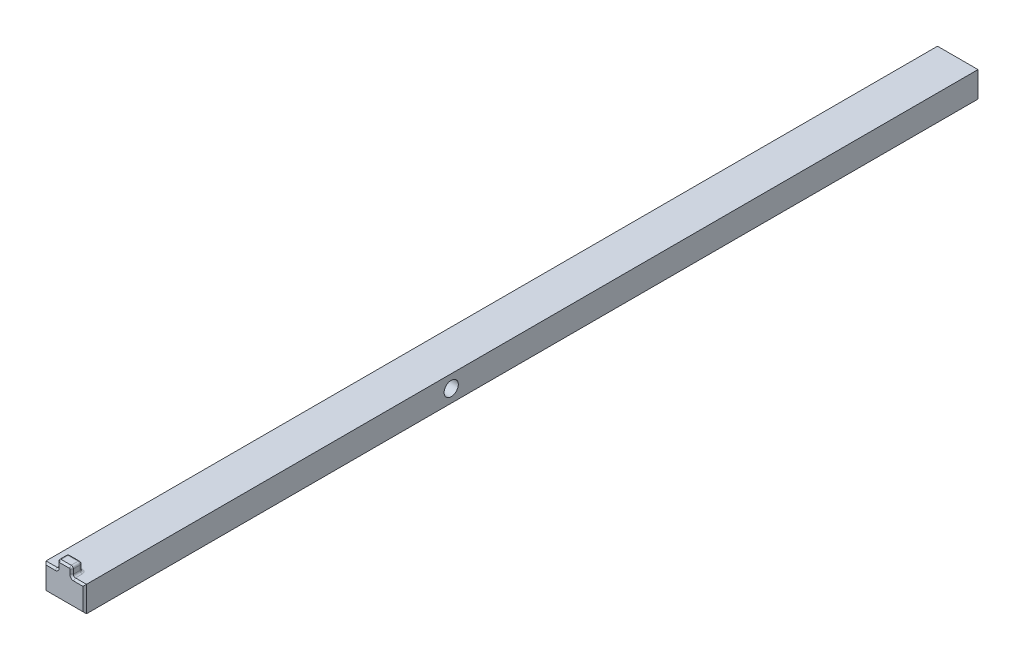
ISO-10303-21;
HEADER;
FILE_DESCRIPTION(('STEP AP214'),'2;1');
FILE_NAME('part.step','',(''),(''),'','','');
FILE_SCHEMA(('AUTOMOTIVE_DESIGN { 1 0 10303 214 1 1 1 1 }'));
ENDSEC;
DATA;
#1=APPLICATION_CONTEXT('core data for automotive mechanical design processes');
#2=APPLICATION_PROTOCOL_DEFINITION('international standard','automotive_design',2000,#1);
#3=PRODUCT_CONTEXT('',#1,'mechanical');
#4=PRODUCT('Part','Part','',(#3));
#5=PRODUCT_RELATED_PRODUCT_CATEGORY('part','',(#4));
#6=PRODUCT_DEFINITION_FORMATION('','',#4);
#7=PRODUCT_DEFINITION_CONTEXT('part definition',#1,'design');
#8=PRODUCT_DEFINITION('design','',#6,#7);
#9=PRODUCT_DEFINITION_SHAPE('','',#8);
#10=(LENGTH_UNIT() NAMED_UNIT(*) SI_UNIT(.MILLI.,.METRE.));
#11=(NAMED_UNIT(*) PLANE_ANGLE_UNIT() SI_UNIT($,.RADIAN.));
#12=(NAMED_UNIT(*) SI_UNIT($,.STERADIAN.) SOLID_ANGLE_UNIT());
#13=UNCERTAINTY_MEASURE_WITH_UNIT(LENGTH_MEASURE(1.E-05),#10,'distance_accuracy_value','');
#14=(GEOMETRIC_REPRESENTATION_CONTEXT(3) GLOBAL_UNCERTAINTY_ASSIGNED_CONTEXT((#13)) GLOBAL_UNIT_ASSIGNED_CONTEXT((#10,
#11,#12)) REPRESENTATION_CONTEXT('',''));
#15=CARTESIAN_POINT('',(0.,0.,0.));
#16=DIRECTION('',(0.,0.,1.));
#17=DIRECTION('',(1.,0.,0.));
#18=AXIS2_PLACEMENT_3D('',#15,#16,#17);
#19=CARTESIAN_POINT('',(5.7,-30.784,-36.82));
#20=DIRECTION('',(0.,-1.,0.));
#21=DIRECTION('',(0.,0.,-1.));
#22=AXIS2_PLACEMENT_3D('',#19,#20,#21);
#23=PLANE('',#22);
#24=DIRECTION('',(0.,0.,1.));
#25=VECTOR('',#24,1.);
#26=CARTESIAN_POINT('',(5.7,-30.784,-36.82));
#27=LINE('',#26,#25);
#28=CARTESIAN_POINT('',(5.7,-30.784,-288.32));
#29=VERTEX_POINT('',#28);
#30=CARTESIAN_POINT('',(5.7,-30.784,-37.32));
#31=VERTEX_POINT('',#30);
#32=EDGE_CURVE('E214',#29,#31,#27,.T.);
#33=ORIENTED_EDGE('',*,*,#32,.F.);
#34=DIRECTION('',(-1.,0.,0.));
#35=VECTOR('',#34,1.);
#36=CARTESIAN_POINT('',(5.7,-30.784,-288.32));
#37=LINE('',#36,#35);
#38=CARTESIAN_POINT('',(-5.7,-30.784,-288.32));
#39=VERTEX_POINT('',#38);
#40=EDGE_CURVE('E307',#29,#39,#37,.T.);
#41=ORIENTED_EDGE('',*,*,#40,.T.);
#42=DIRECTION('',(0.,0.,1.));
#43=VECTOR('',#42,1.);
#44=CARTESIAN_POINT('',(-5.7,-30.784,-36.82));
#45=LINE('',#44,#43);
#46=CARTESIAN_POINT('',(-5.7,-30.784,-37.32));
#47=VERTEX_POINT('',#46);
#48=EDGE_CURVE('E476',#39,#47,#45,.T.);
#49=ORIENTED_EDGE('',*,*,#48,.T.);
#50=DIRECTION('',(1.,0.,0.));
#51=VECTOR('',#50,1.);
#52=CARTESIAN_POINT('',(5.7,-30.784,-37.32));
#53=LINE('',#52,#51);
#54=CARTESIAN_POINT('',(-2.6,-30.784,-37.32));
#55=VERTEX_POINT('',#54);
#56=EDGE_CURVE('E304',#47,#55,#53,.T.);
#57=ORIENTED_EDGE('',*,*,#56,.T.);
#58=DIRECTION('',(0.,0.,1.));
#59=VECTOR('',#58,1.);
#60=CARTESIAN_POINT('',(-2.6,-30.784,-36.82));
#61=LINE('',#60,#59);
#62=CARTESIAN_POINT('',(-2.6,-30.784,-39.22));
#63=VERTEX_POINT('',#62);
#64=EDGE_CURVE('E232',#55,#63,#61,.F.);
#65=ORIENTED_EDGE('',*,*,#64,.T.);
#66=CARTESIAN_POINT('',(-1.4,-30.784,-39.22));
#67=DIRECTION('',(0.,-1.,0.));
#68=DIRECTION('',(0.,0.,-1.));
#69=AXIS2_PLACEMENT_3D('',#66,#67,#68);
#70=CIRCLE('',#69,1.2);
#71=CARTESIAN_POINT('',(-1.4,-30.784,-40.42));
#72=VERTEX_POINT('',#71);
#73=EDGE_CURVE('E229',#72,#63,#70,.F.);
#74=ORIENTED_EDGE('',*,*,#73,.F.);
#75=DIRECTION('',(1.,0.,0.));
#76=VECTOR('',#75,1.);
#77=CARTESIAN_POINT('',(2.,-30.784,-40.42));
#78=LINE('',#77,#76);
#79=CARTESIAN_POINT('',(1.4,-30.784,-40.42));
#80=VERTEX_POINT('',#79);
#81=EDGE_CURVE('E224',#72,#80,#78,.T.);
#82=ORIENTED_EDGE('',*,*,#81,.T.);
#83=CARTESIAN_POINT('',(1.4,-30.784,-39.22));
#84=DIRECTION('',(0.,-1.,0.));
#85=DIRECTION('',(0.,0.,-1.));
#86=AXIS2_PLACEMENT_3D('',#83,#84,#85);
#87=CIRCLE('',#86,1.2);
#88=CARTESIAN_POINT('',(2.6,-30.784,-39.22));
#89=VERTEX_POINT('',#88);
#90=EDGE_CURVE('E221',#89,#80,#87,.F.);
#91=ORIENTED_EDGE('',*,*,#90,.F.);
#92=DIRECTION('',(0.,0.,1.));
#93=VECTOR('',#92,1.);
#94=CARTESIAN_POINT('',(2.6,-30.784,-36.82));
#95=LINE('',#94,#93);
#96=CARTESIAN_POINT('',(2.6,-30.784,-37.32));
#97=VERTEX_POINT('',#96);
#98=EDGE_CURVE('E226',#89,#97,#95,.T.);
#99=ORIENTED_EDGE('',*,*,#98,.T.);
#100=DIRECTION('',(1.,0.,0.));
#101=VECTOR('',#100,1.);
#102=CARTESIAN_POINT('',(5.7,-30.784,-37.32));
#103=LINE('',#102,#101);
#104=EDGE_CURVE('E302',#97,#31,#103,.T.);
#105=ORIENTED_EDGE('',*,*,#104,.T.);
#106=EDGE_LOOP('',(#33,#41,#49,#57,#65,#74,#82,#91,#99,#105));
#107=FACE_BOUND('',#106,.T.);
#108=ADVANCED_FACE('F17',(#107),#23,.F.);
#109=CARTESIAN_POINT('',(5.7,0.,0.));
#110=DIRECTION('',(1.,0.,0.));
#111=DIRECTION('',(0.,0.,-1.));
#112=AXIS2_PLACEMENT_3D('',#109,#110,#111);
#113=PLANE('',#112);
#114=DIRECTION('',(0.,0.,-1.));
#115=VECTOR('',#114,1.);
#116=CARTESIAN_POINT('',(5.7,-37.984,-36.82));
#117=LINE('',#116,#115);
#118=CARTESIAN_POINT('',(5.7,-37.984,-37.32));
#119=VERTEX_POINT('',#118);
#120=CARTESIAN_POINT('',(5.7,-37.984,-288.32));
#121=VERTEX_POINT('',#120);
#122=EDGE_CURVE('E211',#119,#121,#117,.T.);
#123=ORIENTED_EDGE('',*,*,#122,.T.);
#124=DIRECTION('',(0.,1.,0.));
#125=VECTOR('',#124,1.);
#126=CARTESIAN_POINT('',(5.7,-30.784,-288.32));
#127=LINE('',#126,#125);
#128=EDGE_CURVE('E282',#121,#29,#127,.T.);
#129=ORIENTED_EDGE('',*,*,#128,.T.);
#130=ORIENTED_EDGE('',*,*,#32,.T.);
#131=DIRECTION('',(0.,-1.,0.));
#132=VECTOR('',#131,1.);
#133=CARTESIAN_POINT('',(5.7,-37.984,-37.32));
#134=LINE('',#133,#132);
#135=EDGE_CURVE('E254',#31,#119,#134,.T.);
#136=ORIENTED_EDGE('',*,*,#135,.T.);
#137=EDGE_LOOP('',(#123,#129,#130,#136));
#138=FACE_BOUND('',#137,.T.);
#139=CARTESIAN_POINT('',(5.7,-34.384,-140.));
#140=DIRECTION('',(1.,0.,0.));
#141=DIRECTION('',(0.,0.,-1.));
#142=AXIS2_PLACEMENT_3D('',#139,#140,#141);
#143=CIRCLE('',#142,2.);
#144=CARTESIAN_POINT('',(5.7,-34.384,-142.));
#145=VERTEX_POINT('',#144);
#146=EDGE_CURVE('E479',#145,#145,#143,.T.);
#147=ORIENTED_EDGE('',*,*,#146,.F.);
#148=EDGE_LOOP('',(#147));
#149=FACE_BOUND('',#148,.T.);
#150=ADVANCED_FACE('F455',(#138,#149),#113,.T.);
#151=CARTESIAN_POINT('',(-5.7,0.,0.));
#152=DIRECTION('',(1.,0.,0.));
#153=DIRECTION('',(0.,0.,-1.));
#154=AXIS2_PLACEMENT_3D('',#151,#152,#153);
#155=PLANE('',#154);
#156=ORIENTED_EDGE('',*,*,#48,.F.);
#157=DIRECTION('',(0.,-1.,0.));
#158=VECTOR('',#157,1.);
#159=CARTESIAN_POINT('',(-5.7,0.,-288.32));
#160=LINE('',#159,#158);
#161=CARTESIAN_POINT('',(-5.7,-37.984,-288.32));
#162=VERTEX_POINT('',#161);
#163=EDGE_CURVE('E300',#39,#162,#160,.T.);
#164=ORIENTED_EDGE('',*,*,#163,.T.);
#165=DIRECTION('',(0.,0.,-1.));
#166=VECTOR('',#165,1.);
#167=CARTESIAN_POINT('',(-5.7,-37.984,-36.82));
#168=LINE('',#167,#166);
#169=CARTESIAN_POINT('',(-5.7,-37.984,-37.32));
#170=VERTEX_POINT('',#169);
#171=EDGE_CURVE('E217',#170,#162,#168,.T.);
#172=ORIENTED_EDGE('',*,*,#171,.F.);
#173=DIRECTION('',(0.,1.,0.));
#174=VECTOR('',#173,1.);
#175=CARTESIAN_POINT('',(-5.7,0.,-37.32));
#176=LINE('',#175,#174);
#177=EDGE_CURVE('E298',#170,#47,#176,.T.);
#178=ORIENTED_EDGE('',*,*,#177,.T.);
#179=EDGE_LOOP('',(#156,#164,#172,#178));
#180=FACE_BOUND('',#179,.T.);
#181=CARTESIAN_POINT('',(-5.7,-34.384,-140.));
#182=DIRECTION('',(1.,0.,0.));
#183=DIRECTION('',(0.,0.,-1.));
#184=AXIS2_PLACEMENT_3D('',#181,#182,#183);
#185=CIRCLE('',#184,2.);
#186=CARTESIAN_POINT('',(-5.7,-34.384,-142.));
#187=VERTEX_POINT('',#186);
#188=EDGE_CURVE('E280',#187,#187,#185,.T.);
#189=ORIENTED_EDGE('',*,*,#188,.T.);
#190=EDGE_LOOP('',(#189));
#191=FACE_BOUND('',#190,.T.);
#192=ADVANCED_FACE('F487',(#180,#191),#155,.F.);
#193=CARTESIAN_POINT('',(5.7,-30.784,-288.82));
#194=DIRECTION('',(0.,0.,1.));
#195=DIRECTION('',(1.,0.,0.));
#196=AXIS2_PLACEMENT_3D('',#193,#194,#195);
#197=PLANE('',#196);
#198=DIRECTION('',(1.,0.,0.));
#199=VECTOR('',#198,1.);
#200=CARTESIAN_POINT('',(5.7,-31.284,-288.82));
#201=LINE('',#200,#199);
#202=CARTESIAN_POINT('',(-5.19999999999994,-31.284,-288.82));
#203=VERTEX_POINT('',#202);
#204=CARTESIAN_POINT('',(5.19999999999994,-31.284,-288.82));
#205=VERTEX_POINT('',#204);
#206=EDGE_CURVE('E285',#203,#205,#201,.T.);
#207=ORIENTED_EDGE('',*,*,#206,.T.);
#208=DIRECTION('',(0.,-1.,0.));
#209=VECTOR('',#208,1.);
#210=CARTESIAN_POINT('',(5.19999999999994,-37.984,-288.82));
#211=LINE('',#210,#209);
#212=CARTESIAN_POINT('',(5.19999999999994,-37.484,-288.82));
#213=VERTEX_POINT('',#212);
#214=EDGE_CURVE('E291',#205,#213,#211,.T.);
#215=ORIENTED_EDGE('',*,*,#214,.T.);
#216=DIRECTION('',(-1.,0.,0.));
#217=VECTOR('',#216,1.);
#218=CARTESIAN_POINT('',(5.7,-37.484,-288.82));
#219=LINE('',#218,#217);
#220=CARTESIAN_POINT('',(-5.19999999999994,-37.484,-288.82));
#221=VERTEX_POINT('',#220);
#222=EDGE_CURVE('E289',#213,#221,#219,.T.);
#223=ORIENTED_EDGE('',*,*,#222,.T.);
#224=DIRECTION('',(0.,1.,0.));
#225=VECTOR('',#224,1.);
#226=CARTESIAN_POINT('',(-5.19999999999994,-30.784,-288.82));
#227=LINE('',#226,#225);
#228=EDGE_CURVE('E287',#221,#203,#227,.T.);
#229=ORIENTED_EDGE('',*,*,#228,.T.);
#230=EDGE_LOOP('',(#207,#215,#223,#229));
#231=FACE_BOUND('',#230,.T.);
#232=ADVANCED_FACE('F507',(#231),#197,.F.);
#233=CARTESIAN_POINT('',(5.7,-30.784,-36.82));
#234=DIRECTION('',(0.,0.,-1.));
#235=DIRECTION('',(-1.,0.,0.));
#236=AXIS2_PLACEMENT_3D('',#233,#234,#235);
#237=PLANE('',#236);
#238=CARTESIAN_POINT('',(-2.6,-30.184,-36.82));
#239=DIRECTION('',(0.,0.,-1.));
#240=DIRECTION('',(-1.,0.,0.));
#241=AXIS2_PLACEMENT_3D('',#238,#239,#240);
#242=CIRCLE('',#241,1.10000000000002);
#243=CARTESIAN_POINT('',(-1.49999999999997,-30.184,-36.82));
#244=VERTEX_POINT('',#243);
#245=CARTESIAN_POINT('',(-2.6,-31.284,-36.82));
#246=VERTEX_POINT('',#245);
#247=EDGE_CURVE('E329',#244,#246,#242,.T.);
#248=ORIENTED_EDGE('',*,*,#247,.T.);
#249=DIRECTION('',(-1.,0.,0.));
#250=VECTOR('',#249,1.);
#251=CARTESIAN_POINT('',(5.7,-31.284,-36.82));
#252=LINE('',#251,#250);
#253=CARTESIAN_POINT('',(-5.2,-31.284,-36.82));
#254=VERTEX_POINT('',#253);
#255=EDGE_CURVE('E331',#246,#254,#252,.T.);
#256=ORIENTED_EDGE('',*,*,#255,.T.);
#257=DIRECTION('',(0.,-1.,0.));
#258=VECTOR('',#257,1.);
#259=CARTESIAN_POINT('',(-5.2,-30.784,-36.82));
#260=LINE('',#259,#258);
#261=CARTESIAN_POINT('',(-5.2,-37.484,-36.82));
#262=VERTEX_POINT('',#261);
#263=EDGE_CURVE('E313',#254,#262,#260,.T.);
#264=ORIENTED_EDGE('',*,*,#263,.T.);
#265=DIRECTION('',(1.,0.,0.));
#266=VECTOR('',#265,1.);
#267=CARTESIAN_POINT('',(5.7,-37.484,-36.82));
#268=LINE('',#267,#266);
#269=CARTESIAN_POINT('',(5.2,-37.484,-36.82));
#270=VERTEX_POINT('',#269);
#271=EDGE_CURVE('E311',#262,#270,#268,.T.);
#272=ORIENTED_EDGE('',*,*,#271,.T.);
#273=DIRECTION('',(0.,1.,0.));
#274=VECTOR('',#273,1.);
#275=CARTESIAN_POINT('',(5.2,-30.784,-36.82));
#276=LINE('',#275,#274);
#277=CARTESIAN_POINT('',(5.2,-31.284,-36.82));
#278=VERTEX_POINT('',#277);
#279=EDGE_CURVE('E309',#270,#278,#276,.T.);
#280=ORIENTED_EDGE('',*,*,#279,.T.);
#281=DIRECTION('',(-1.,0.,0.));
#282=VECTOR('',#281,1.);
#283=CARTESIAN_POINT('',(5.7,-31.284,-36.82));
#284=LINE('',#283,#282);
#285=CARTESIAN_POINT('',(2.6,-31.284,-36.82));
#286=VERTEX_POINT('',#285);
#287=EDGE_CURVE('E315',#278,#286,#284,.T.);
#288=ORIENTED_EDGE('',*,*,#287,.T.);
#289=CARTESIAN_POINT('',(2.6,-30.184,-36.82));
#290=DIRECTION('',(0.,0.,-1.));
#291=DIRECTION('',(-1.,0.,0.));
#292=AXIS2_PLACEMENT_3D('',#289,#290,#291);
#293=CIRCLE('',#292,1.10000000000002);
#294=CARTESIAN_POINT('',(1.49999999999997,-30.184,-36.82));
#295=VERTEX_POINT('',#294);
#296=EDGE_CURVE('E317',#286,#295,#293,.T.);
#297=ORIENTED_EDGE('',*,*,#296,.T.);
#298=DIRECTION('',(0.,1.,0.));
#299=VECTOR('',#298,1.);
#300=CARTESIAN_POINT('',(1.49999999999997,-28.884,-36.82));
#301=LINE('',#300,#299);
#302=CARTESIAN_POINT('',(1.49999999999997,-28.884,-36.82));
#303=VERTEX_POINT('',#302);
#304=EDGE_CURVE('E319',#295,#303,#301,.T.);
#305=ORIENTED_EDGE('',*,*,#304,.T.);
#306=CARTESIAN_POINT('',(1.4,-28.884,-36.82));
#307=DIRECTION('',(0.,0.,-1.));
#308=DIRECTION('',(-1.,0.,0.));
#309=AXIS2_PLACEMENT_3D('',#306,#307,#308);
#310=CIRCLE('',#309,0.0999999999999716);
#311=CARTESIAN_POINT('',(1.4,-28.784,-36.82));
#312=VERTEX_POINT('',#311);
#313=EDGE_CURVE('E321',#303,#312,#310,.F.);
#314=ORIENTED_EDGE('',*,*,#313,.T.);
#315=DIRECTION('',(-1.,0.,0.));
#316=VECTOR('',#315,1.);
#317=CARTESIAN_POINT('',(-1.4,-28.784,-36.82));
#318=LINE('',#317,#316);
#319=CARTESIAN_POINT('',(-1.4,-28.784,-36.82));
#320=VERTEX_POINT('',#319);
#321=EDGE_CURVE('E323',#312,#320,#318,.T.);
#322=ORIENTED_EDGE('',*,*,#321,.T.);
#323=CARTESIAN_POINT('',(-1.4,-28.884,-36.82));
#324=DIRECTION('',(0.,0.,-1.));
#325=DIRECTION('',(-1.,0.,0.));
#326=AXIS2_PLACEMENT_3D('',#323,#324,#325);
#327=CIRCLE('',#326,0.0999999999999716);
#328=CARTESIAN_POINT('',(-1.49999999999997,-28.884,-36.82));
#329=VERTEX_POINT('',#328);
#330=EDGE_CURVE('E325',#320,#329,#327,.F.);
#331=ORIENTED_EDGE('',*,*,#330,.T.);
#332=DIRECTION('',(0.,-1.,0.));
#333=VECTOR('',#332,1.);
#334=CARTESIAN_POINT('',(-1.49999999999997,-30.184,-36.82));
#335=LINE('',#334,#333);
#336=EDGE_CURVE('E327',#329,#244,#335,.T.);
#337=ORIENTED_EDGE('',*,*,#336,.T.);
#338=EDGE_LOOP('',(#248,#256,#264,#272,#280,#288,#297,#305,#314,#322,#331,#337));
#339=FACE_BOUND('',#338,.T.);
#340=ADVANCED_FACE('F441',(#339),#237,.F.);
#341=CARTESIAN_POINT('',(5.7,-37.984,-36.82));
#342=DIRECTION('',(0.,1.,0.));
#343=DIRECTION('',(0.,0.,1.));
#344=AXIS2_PLACEMENT_3D('',#341,#342,#343);
#345=PLANE('',#344);
#346=ORIENTED_EDGE('',*,*,#171,.T.);
#347=DIRECTION('',(1.,0.,0.));
#348=VECTOR('',#347,1.);
#349=CARTESIAN_POINT('',(5.7,-37.984,-288.32));
#350=LINE('',#349,#348);
#351=EDGE_CURVE('E296',#162,#121,#350,.T.);
#352=ORIENTED_EDGE('',*,*,#351,.T.);
#353=ORIENTED_EDGE('',*,*,#122,.F.);
#354=DIRECTION('',(-1.,0.,0.));
#355=VECTOR('',#354,1.);
#356=CARTESIAN_POINT('',(5.7,-37.984,-37.32));
#357=LINE('',#356,#355);
#358=EDGE_CURVE('E294',#119,#170,#357,.T.);
#359=ORIENTED_EDGE('',*,*,#358,.T.);
#360=EDGE_LOOP('',(#346,#352,#353,#359));
#361=FACE_BOUND('',#360,.T.);
#362=ADVANCED_FACE('F460',(#361),#345,.F.);
#363=CARTESIAN_POINT('',(5.7,-34.384,-140.));
#364=DIRECTION('',(-1.,0.,0.));
#365=DIRECTION('',(0.,0.,1.));
#366=AXIS2_PLACEMENT_3D('',#363,#364,#365);
#367=CYLINDRICAL_SURFACE('',#366,2.);
#368=ORIENTED_EDGE('',*,*,#146,.T.);
#369=EDGE_LOOP('',(#368));
#370=FACE_BOUND('',#369,.T.);
#371=ORIENTED_EDGE('',*,*,#188,.F.);
#372=EDGE_LOOP('',(#371));
#373=FACE_BOUND('',#372,.T.);
#374=ADVANCED_FACE('F489',(#370,#373),#367,.F.);
#375=CARTESIAN_POINT('',(-2.,-28.284,-39.82));
#376=DIRECTION('',(-1.,0.,0.));
#377=DIRECTION('',(0.,0.,1.));
#378=AXIS2_PLACEMENT_3D('',#375,#376,#377);
#379=PLANE('',#378);
#380=DIRECTION('',(0.,0.,1.));
#381=VECTOR('',#380,1.);
#382=CARTESIAN_POINT('',(-2.,-30.184,-39.82));
#383=LINE('',#382,#381);
#384=CARTESIAN_POINT('',(-2.,-30.184,-39.22));
#385=VERTEX_POINT('',#384);
#386=CARTESIAN_POINT('',(-2.,-30.184,-37.32));
#387=VERTEX_POINT('',#386);
#388=EDGE_CURVE('E185',#385,#387,#383,.T.);
#389=ORIENTED_EDGE('',*,*,#388,.T.);
#390=DIRECTION('',(0.,1.,0.));
#391=VECTOR('',#390,1.);
#392=CARTESIAN_POINT('',(-2.,-28.884,-37.32));
#393=LINE('',#392,#391);
#394=CARTESIAN_POINT('',(-2.,-28.884,-37.32));
#395=VERTEX_POINT('',#394);
#396=EDGE_CURVE('E182',#387,#395,#393,.T.);
#397=ORIENTED_EDGE('',*,*,#396,.T.);
#398=DIRECTION('',(0.,0.,1.));
#399=VECTOR('',#398,1.);
#400=CARTESIAN_POINT('',(-2.,-28.884,-39.82));
#401=LINE('',#400,#399);
#402=CARTESIAN_POINT('',(-2.,-28.884,-39.22));
#403=VERTEX_POINT('',#402);
#404=EDGE_CURVE('E174',#395,#403,#401,.F.);
#405=ORIENTED_EDGE('',*,*,#404,.T.);
#406=DIRECTION('',(0.,-1.,0.));
#407=VECTOR('',#406,1.);
#408=CARTESIAN_POINT('',(-2.,-30.784,-39.22));
#409=LINE('',#408,#407);
#410=EDGE_CURVE('E179',#403,#385,#409,.T.);
#411=ORIENTED_EDGE('',*,*,#410,.T.);
#412=EDGE_LOOP('',(#389,#397,#405,#411));
#413=FACE_BOUND('',#412,.T.);
#414=ADVANCED_FACE('F177',(#413),#379,.T.);
#415=CARTESIAN_POINT('',(2.,-28.284,-39.82));
#416=DIRECTION('',(0.,1.,0.));
#417=DIRECTION('',(0.,0.,1.));
#418=AXIS2_PLACEMENT_3D('',#415,#416,#417);
#419=PLANE('',#418);
#420=DIRECTION('',(0.,0.,1.));
#421=VECTOR('',#420,1.);
#422=CARTESIAN_POINT('',(-1.4,-28.284,-39.82));
#423=LINE('',#422,#421);
#424=CARTESIAN_POINT('',(-1.4,-28.284,-39.22));
#425=VERTEX_POINT('',#424);
#426=CARTESIAN_POINT('',(-1.4,-28.284,-37.32));
#427=VERTEX_POINT('',#426);
#428=EDGE_CURVE('E193',#425,#427,#423,.T.);
#429=ORIENTED_EDGE('',*,*,#428,.T.);
#430=DIRECTION('',(1.,0.,0.));
#431=VECTOR('',#430,1.);
#432=CARTESIAN_POINT('',(1.4,-28.284,-37.32));
#433=LINE('',#432,#431);
#434=CARTESIAN_POINT('',(1.4,-28.284,-37.32));
#435=VERTEX_POINT('',#434);
#436=EDGE_CURVE('E339',#427,#435,#433,.T.);
#437=ORIENTED_EDGE('',*,*,#436,.T.);
#438=DIRECTION('',(0.,0.,1.));
#439=VECTOR('',#438,1.);
#440=CARTESIAN_POINT('',(1.4,-28.284,-39.82));
#441=LINE('',#440,#439);
#442=CARTESIAN_POINT('',(1.4,-28.284,-39.22));
#443=VERTEX_POINT('',#442);
#444=EDGE_CURVE('E242',#435,#443,#441,.F.);
#445=ORIENTED_EDGE('',*,*,#444,.T.);
#446=DIRECTION('',(-1.,0.,0.));
#447=VECTOR('',#446,1.);
#448=CARTESIAN_POINT('',(-2.,-28.284,-39.22));
#449=LINE('',#448,#447);
#450=EDGE_CURVE('E240',#443,#425,#449,.T.);
#451=ORIENTED_EDGE('',*,*,#450,.T.);
#452=EDGE_LOOP('',(#429,#437,#445,#451));
#453=FACE_BOUND('',#452,.T.);
#454=ADVANCED_FACE('F429',(#453),#419,.T.);
#455=CARTESIAN_POINT('',(2.,-30.784,-39.82));
#456=DIRECTION('',(1.,0.,0.));
#457=DIRECTION('',(0.,0.,-1.));
#458=AXIS2_PLACEMENT_3D('',#455,#456,#457);
#459=PLANE('',#458);
#460=DIRECTION('',(0.,0.,1.));
#461=VECTOR('',#460,1.);
#462=CARTESIAN_POINT('',(2.,-28.884,-39.82));
#463=LINE('',#462,#461);
#464=CARTESIAN_POINT('',(2.,-28.884,-39.22));
#465=VERTEX_POINT('',#464);
#466=CARTESIAN_POINT('',(2.,-28.884,-37.32));
#467=VERTEX_POINT('',#466);
#468=EDGE_CURVE('E236',#465,#467,#463,.T.);
#469=ORIENTED_EDGE('',*,*,#468,.T.);
#470=DIRECTION('',(0.,-1.,0.));
#471=VECTOR('',#470,1.);
#472=CARTESIAN_POINT('',(2.,-30.184,-37.32));
#473=LINE('',#472,#471);
#474=CARTESIAN_POINT('',(2.,-30.184,-37.32));
#475=VERTEX_POINT('',#474);
#476=EDGE_CURVE('E27',#467,#475,#473,.T.);
#477=ORIENTED_EDGE('',*,*,#476,.T.);
#478=DIRECTION('',(0.,0.,1.));
#479=VECTOR('',#478,1.);
#480=CARTESIAN_POINT('',(2.,-30.184,-39.82));
#481=LINE('',#480,#479);
#482=CARTESIAN_POINT('',(2.,-30.184,-39.22));
#483=VERTEX_POINT('',#482);
#484=EDGE_CURVE('E238',#475,#483,#481,.F.);
#485=ORIENTED_EDGE('',*,*,#484,.T.);
#486=DIRECTION('',(0.,1.,0.));
#487=VECTOR('',#486,1.);
#488=CARTESIAN_POINT('',(2.,-28.284,-39.22));
#489=LINE('',#488,#487);
#490=EDGE_CURVE('E234',#483,#465,#489,.T.);
#491=ORIENTED_EDGE('',*,*,#490,.T.);
#492=EDGE_LOOP('',(#469,#477,#485,#491));
#493=FACE_BOUND('',#492,.T.);
#494=ADVANCED_FACE('F419',(#493),#459,.T.);
#495=CARTESIAN_POINT('',(0.,0.,-39.82));
#496=DIRECTION('',(0.,0.,1.));
#497=DIRECTION('',(1.,0.,0.));
#498=AXIS2_PLACEMENT_3D('',#495,#496,#497);
#499=PLANE('',#498);
#500=DIRECTION('',(1.,0.,0.));
#501=VECTOR('',#500,1.);
#502=CARTESIAN_POINT('',(-2.,-30.184,-39.82));
#503=LINE('',#502,#501);
#504=CARTESIAN_POINT('',(1.4,-30.184,-39.82));
#505=VERTEX_POINT('',#504);
#506=CARTESIAN_POINT('',(-1.4,-30.184,-39.82));
#507=VERTEX_POINT('',#506);
#508=EDGE_CURVE('E247',#505,#507,#503,.F.);
#509=ORIENTED_EDGE('',*,*,#508,.T.);
#510=DIRECTION('',(0.,-1.,0.));
#511=VECTOR('',#510,1.);
#512=CARTESIAN_POINT('',(-1.4,-28.284,-39.82));
#513=LINE('',#512,#511);
#514=CARTESIAN_POINT('',(-1.4,-28.884,-39.82));
#515=VERTEX_POINT('',#514);
#516=EDGE_CURVE('E252',#507,#515,#513,.F.);
#517=ORIENTED_EDGE('',*,*,#516,.T.);
#518=DIRECTION('',(-1.,0.,0.));
#519=VECTOR('',#518,1.);
#520=CARTESIAN_POINT('',(2.,-28.884,-39.82));
#521=LINE('',#520,#519);
#522=CARTESIAN_POINT('',(1.4,-28.884,-39.82));
#523=VERTEX_POINT('',#522);
#524=EDGE_CURVE('E249',#515,#523,#521,.F.);
#525=ORIENTED_EDGE('',*,*,#524,.T.);
#526=DIRECTION('',(0.,1.,0.));
#527=VECTOR('',#526,1.);
#528=CARTESIAN_POINT('',(1.4,-30.784,-39.82));
#529=LINE('',#528,#527);
#530=EDGE_CURVE('E245',#523,#505,#529,.F.);
#531=ORIENTED_EDGE('',*,*,#530,.T.);
#532=EDGE_LOOP('',(#509,#517,#525,#531));
#533=FACE_BOUND('',#532,.T.);
#534=ADVANCED_FACE('F412',(#533),#499,.F.);
#535=CARTESIAN_POINT('',(1.4,-28.884,-39.82));
#536=DIRECTION('',(0.,0.,1.));
#537=DIRECTION('',(1.,0.,0.));
#538=AXIS2_PLACEMENT_3D('',#535,#536,#537);
#539=CYLINDRICAL_SURFACE('',#538,0.6);
#540=ORIENTED_EDGE('',*,*,#444,.F.);
#541=CARTESIAN_POINT('',(1.4,-28.884,-37.32));
#542=DIRECTION('',(0.,0.,-1.));
#543=DIRECTION('',(-1.,0.,0.));
#544=AXIS2_PLACEMENT_3D('',#541,#542,#543);
#545=CIRCLE('',#544,0.6);
#546=EDGE_CURVE('E42',#435,#467,#545,.T.);
#547=ORIENTED_EDGE('',*,*,#546,.T.);
#548=ORIENTED_EDGE('',*,*,#468,.F.);
#549=CARTESIAN_POINT('',(1.4,-28.884,-39.22));
#550=DIRECTION('',(0.,0.,-1.));
#551=DIRECTION('',(-1.,0.,0.));
#552=AXIS2_PLACEMENT_3D('',#549,#550,#551);
#553=CIRCLE('',#552,0.6);
#554=EDGE_CURVE('E277',#443,#465,#553,.T.);
#555=ORIENTED_EDGE('',*,*,#554,.F.);
#556=EDGE_LOOP('',(#540,#547,#548,#555));
#557=FACE_BOUND('',#556,.T.);
#558=ADVANCED_FACE('F421',(#557),#539,.T.);
#559=CARTESIAN_POINT('',(1.4,-28.884,-39.22));
#560=DIRECTION('',(1.,0.,0.));
#561=DIRECTION('',(0.,0.,-1.));
#562=AXIS2_PLACEMENT_3D('',#559,#560,#561);
#563=SPHERICAL_SURFACE('',#562,0.6);
#564=CARTESIAN_POINT('',(1.4,-28.884,-39.22));
#565=DIRECTION('',(1.,0.,0.));
#566=DIRECTION('',(0.,0.,-1.));
#567=AXIS2_PLACEMENT_3D('',#564,#565,#566);
#568=CIRCLE('',#567,0.6);
#569=EDGE_CURVE('E271',#443,#523,#568,.F.);
#570=ORIENTED_EDGE('',*,*,#569,.F.);
#571=ORIENTED_EDGE('',*,*,#554,.T.);
#572=CARTESIAN_POINT('',(1.4,-28.884,-39.22));
#573=DIRECTION('',(0.,1.,0.));
#574=DIRECTION('',(0.,0.,1.));
#575=AXIS2_PLACEMENT_3D('',#572,#573,#574);
#576=CIRCLE('',#575,0.6);
#577=EDGE_CURVE('E274',#523,#465,#576,.F.);
#578=ORIENTED_EDGE('',*,*,#577,.F.);
#579=EDGE_LOOP('',(#570,#571,#578));
#580=FACE_BOUND('',#579,.T.);
#581=ADVANCED_FACE('F424',(#580),#563,.T.);
#582=CARTESIAN_POINT('',(2.6,-30.184,-36.82));
#583=DIRECTION('',(0.,0.,1.));
#584=DIRECTION('',(0.,-1.,0.));
#585=AXIS2_PLACEMENT_3D('',#582,#583,#584);
#586=CYLINDRICAL_SURFACE('',#585,0.6);
#587=ORIENTED_EDGE('',*,*,#484,.F.);
#588=CARTESIAN_POINT('',(2.6,-30.184,-37.32));
#589=DIRECTION('',(0.,0.,-1.));
#590=DIRECTION('',(-1.,0.,0.));
#591=AXIS2_PLACEMENT_3D('',#588,#589,#590);
#592=CIRCLE('',#591,0.6);
#593=EDGE_CURVE('E11',#475,#97,#592,.F.);
#594=ORIENTED_EDGE('',*,*,#593,.T.);
#595=ORIENTED_EDGE('',*,*,#98,.F.);
#596=CARTESIAN_POINT('',(2.6,-30.184,-39.22));
#597=DIRECTION('',(0.,0.,1.));
#598=DIRECTION('',(1.,0.,0.));
#599=AXIS2_PLACEMENT_3D('',#596,#597,#598);
#600=CIRCLE('',#599,0.6);
#601=EDGE_CURVE('E268',#483,#89,#600,.T.);
#602=ORIENTED_EDGE('',*,*,#601,.F.);
#603=EDGE_LOOP('',(#587,#594,#595,#602));
#604=FACE_BOUND('',#603,.T.);
#605=ADVANCED_FACE('F398',(#604),#586,.F.);
#606=CARTESIAN_POINT('',(1.4,-30.784,-39.22));
#607=DIRECTION('',(0.,-1.,0.));
#608=DIRECTION('',(0.,0.,-1.));
#609=AXIS2_PLACEMENT_3D('',#606,#607,#608);
#610=CYLINDRICAL_SURFACE('',#609,0.6);
#611=ORIENTED_EDGE('',*,*,#577,.T.);
#612=ORIENTED_EDGE('',*,*,#490,.F.);
#613=CARTESIAN_POINT('',(1.4,-30.184,-39.22));
#614=DIRECTION('',(0.,-1.,0.));
#615=DIRECTION('',(0.,0.,-1.));
#616=AXIS2_PLACEMENT_3D('',#613,#614,#615);
#617=CIRCLE('',#616,0.6);
#618=EDGE_CURVE('E265',#505,#483,#617,.T.);
#619=ORIENTED_EDGE('',*,*,#618,.F.);
#620=ORIENTED_EDGE('',*,*,#530,.F.);
#621=EDGE_LOOP('',(#611,#612,#619,#620));
#622=FACE_BOUND('',#621,.T.);
#623=ADVANCED_FACE('F418',(#622),#610,.T.);
#624=CARTESIAN_POINT('',(2.,-28.884,-39.22));
#625=DIRECTION('',(1.,0.,0.));
#626=DIRECTION('',(0.,0.,-1.));
#627=AXIS2_PLACEMENT_3D('',#624,#625,#626);
#628=CYLINDRICAL_SURFACE('',#627,0.6);
#629=ORIENTED_EDGE('',*,*,#569,.T.);
#630=ORIENTED_EDGE('',*,*,#524,.F.);
#631=CARTESIAN_POINT('',(-1.4,-28.884,-39.22));
#632=DIRECTION('',(-1.,0.,0.));
#633=DIRECTION('',(0.,0.,1.));
#634=AXIS2_PLACEMENT_3D('',#631,#632,#633);
#635=CIRCLE('',#634,0.6);
#636=EDGE_CURVE('E197',#425,#515,#635,.T.);
#637=ORIENTED_EDGE('',*,*,#636,.F.);
#638=ORIENTED_EDGE('',*,*,#450,.F.);
#639=EDGE_LOOP('',(#629,#630,#637,#638));
#640=FACE_BOUND('',#639,.T.);
#641=ADVANCED_FACE('F427',(#640),#628,.T.);
#642=CARTESIAN_POINT('',(-1.4,-28.884,-39.82));
#643=DIRECTION('',(0.,0.,1.));
#644=DIRECTION('',(1.,0.,0.));
#645=AXIS2_PLACEMENT_3D('',#642,#643,#644);
#646=CYLINDRICAL_SURFACE('',#645,0.6);
#647=ORIENTED_EDGE('',*,*,#404,.F.);
#648=CARTESIAN_POINT('',(-1.4,-28.884,-37.32));
#649=DIRECTION('',(0.,0.,-1.));
#650=DIRECTION('',(-1.,0.,0.));
#651=AXIS2_PLACEMENT_3D('',#648,#649,#650);
#652=CIRCLE('',#651,0.6);
#653=EDGE_CURVE('E337',#395,#427,#652,.T.);
#654=ORIENTED_EDGE('',*,*,#653,.T.);
#655=ORIENTED_EDGE('',*,*,#428,.F.);
#656=CARTESIAN_POINT('',(-1.4,-28.884,-39.22));
#657=DIRECTION('',(0.,0.,-1.));
#658=DIRECTION('',(-1.,0.,0.));
#659=AXIS2_PLACEMENT_3D('',#656,#657,#658);
#660=CIRCLE('',#659,0.6);
#661=EDGE_CURVE('E189',#403,#425,#660,.T.);
#662=ORIENTED_EDGE('',*,*,#661,.F.);
#663=EDGE_LOOP('',(#647,#654,#655,#662));
#664=FACE_BOUND('',#663,.T.);
#665=ADVANCED_FACE('F191',(#664),#646,.T.);
#666=CARTESIAN_POINT('',(1.4,-30.184,-39.22));
#667=DIRECTION('',(0.,-1.,0.));
#668=DIRECTION('',(0.,0.,-1.));
#669=AXIS2_PLACEMENT_3D('',#666,#667,#668);
#670=TOROIDAL_SURFACE('',#669,1.2,0.6);
#671=ORIENTED_EDGE('',*,*,#601,.T.);
#672=ORIENTED_EDGE('',*,*,#90,.T.);
#673=CARTESIAN_POINT('',(1.4,-30.184,-40.42));
#674=DIRECTION('',(-1.,0.,0.));
#675=DIRECTION('',(0.,0.,1.));
#676=AXIS2_PLACEMENT_3D('',#673,#674,#675);
#677=CIRCLE('',#676,0.6);
#678=EDGE_CURVE('E198',#505,#80,#677,.F.);
#679=ORIENTED_EDGE('',*,*,#678,.F.);
#680=ORIENTED_EDGE('',*,*,#618,.T.);
#681=EDGE_LOOP('',(#671,#672,#679,#680));
#682=FACE_BOUND('',#681,.T.);
#683=ADVANCED_FACE('F406',(#682),#670,.F.);
#684=CARTESIAN_POINT('',(-1.4,-28.884,-39.22));
#685=DIRECTION('',(0.,1.,0.));
#686=DIRECTION('',(0.,0.,1.));
#687=AXIS2_PLACEMENT_3D('',#684,#685,#686);
#688=SPHERICAL_SURFACE('',#687,0.6);
#689=ORIENTED_EDGE('',*,*,#661,.T.);
#690=ORIENTED_EDGE('',*,*,#636,.T.);
#691=CARTESIAN_POINT('',(-1.4,-28.884,-39.22));
#692=DIRECTION('',(0.,1.,0.));
#693=DIRECTION('',(0.,0.,1.));
#694=AXIS2_PLACEMENT_3D('',#691,#692,#693);
#695=CIRCLE('',#694,0.6);
#696=EDGE_CURVE('E201',#403,#515,#695,.F.);
#697=ORIENTED_EDGE('',*,*,#696,.F.);
#698=EDGE_LOOP('',(#689,#690,#697));
#699=FACE_BOUND('',#698,.T.);
#700=ADVANCED_FACE('F202',(#699),#688,.T.);
#701=CARTESIAN_POINT('',(5.7,-30.184,-40.42));
#702=DIRECTION('',(-1.,0.,0.));
#703=DIRECTION('',(0.,0.,1.));
#704=AXIS2_PLACEMENT_3D('',#701,#702,#703);
#705=CYLINDRICAL_SURFACE('',#704,0.6);
#706=ORIENTED_EDGE('',*,*,#678,.T.);
#707=ORIENTED_EDGE('',*,*,#81,.F.);
#708=CARTESIAN_POINT('',(-1.4,-30.184,-40.42));
#709=DIRECTION('',(1.,0.,0.));
#710=DIRECTION('',(0.,0.,-1.));
#711=AXIS2_PLACEMENT_3D('',#708,#709,#710);
#712=CIRCLE('',#711,0.6);
#713=EDGE_CURVE('E205',#507,#72,#712,.T.);
#714=ORIENTED_EDGE('',*,*,#713,.F.);
#715=ORIENTED_EDGE('',*,*,#508,.F.);
#716=EDGE_LOOP('',(#706,#707,#714,#715));
#717=FACE_BOUND('',#716,.T.);
#718=ADVANCED_FACE('F409',(#717),#705,.F.);
#719=CARTESIAN_POINT('',(-1.4,-28.284,-39.22));
#720=DIRECTION('',(0.,1.,0.));
#721=DIRECTION('',(0.,0.,1.));
#722=AXIS2_PLACEMENT_3D('',#719,#720,#721);
#723=CYLINDRICAL_SURFACE('',#722,0.6);
#724=ORIENTED_EDGE('',*,*,#696,.T.);
#725=ORIENTED_EDGE('',*,*,#516,.F.);
#726=CARTESIAN_POINT('',(-1.4,-30.184,-39.22));
#727=DIRECTION('',(0.,-1.,0.));
#728=DIRECTION('',(0.,0.,-1.));
#729=AXIS2_PLACEMENT_3D('',#726,#727,#728);
#730=CIRCLE('',#729,0.6);
#731=EDGE_CURVE('E209',#385,#507,#730,.T.);
#732=ORIENTED_EDGE('',*,*,#731,.F.);
#733=ORIENTED_EDGE('',*,*,#410,.F.);
#734=EDGE_LOOP('',(#724,#725,#732,#733));
#735=FACE_BOUND('',#734,.T.);
#736=ADVANCED_FACE('F207',(#735),#723,.T.);
#737=CARTESIAN_POINT('',(-1.4,-30.184,-39.22));
#738=DIRECTION('',(0.,-1.,0.));
#739=DIRECTION('',(0.,0.,-1.));
#740=AXIS2_PLACEMENT_3D('',#737,#738,#739);
#741=TOROIDAL_SURFACE('',#740,1.2,0.6);
#742=ORIENTED_EDGE('',*,*,#713,.T.);
#743=ORIENTED_EDGE('',*,*,#73,.T.);
#744=CARTESIAN_POINT('',(-2.6,-30.184,-39.22));
#745=DIRECTION('',(0.,0.,1.));
#746=DIRECTION('',(1.,0.,0.));
#747=AXIS2_PLACEMENT_3D('',#744,#745,#746);
#748=CIRCLE('',#747,0.6);
#749=EDGE_CURVE('E255',#385,#63,#748,.F.);
#750=ORIENTED_EDGE('',*,*,#749,.F.);
#751=ORIENTED_EDGE('',*,*,#731,.T.);
#752=EDGE_LOOP('',(#742,#743,#750,#751));
#753=FACE_BOUND('',#752,.T.);
#754=ADVANCED_FACE('F515',(#753),#741,.F.);
#755=CARTESIAN_POINT('',(-2.6,-30.184,-39.82));
#756=DIRECTION('',(0.,0.,1.));
#757=DIRECTION('',(0.,-1.,0.));
#758=AXIS2_PLACEMENT_3D('',#755,#756,#757);
#759=CYLINDRICAL_SURFACE('',#758,0.6);
#760=ORIENTED_EDGE('',*,*,#64,.F.);
#761=CARTESIAN_POINT('',(-2.6,-30.184,-37.32));
#762=DIRECTION('',(0.,0.,-1.));
#763=DIRECTION('',(-1.,0.,0.));
#764=AXIS2_PLACEMENT_3D('',#761,#762,#763);
#765=CIRCLE('',#764,0.6);
#766=EDGE_CURVE('E334',#55,#387,#765,.F.);
#767=ORIENTED_EDGE('',*,*,#766,.T.);
#768=ORIENTED_EDGE('',*,*,#388,.F.);
#769=ORIENTED_EDGE('',*,*,#749,.T.);
#770=EDGE_LOOP('',(#760,#767,#768,#769));
#771=FACE_BOUND('',#770,.T.);
#772=ADVANCED_FACE('F511',(#771),#759,.F.);
#773=CARTESIAN_POINT('',(-5.19999999999994,-30.784,-288.82));
#774=DIRECTION('',(0.707106781186548,0.,0.707106781186548));
#775=DIRECTION('',(0.,1.,0.));
#776=AXIS2_PLACEMENT_3D('',#773,#774,#775);
#777=PLANE('',#776);
#778=DIRECTION('',(-0.577350269189626,0.577350269189626,0.577350269189626));
#779=VECTOR('',#778,1.);
#780=CARTESIAN_POINT('',(-1.9,-34.584,-292.12));
#781=LINE('',#780,#779);
#782=EDGE_CURVE('E347',#203,#39,#781,.T.);
#783=ORIENTED_EDGE('',*,*,#782,.F.);
#784=ORIENTED_EDGE('',*,*,#228,.F.);
#785=DIRECTION('',(-0.577350269189626,-0.577350269189626,0.577350269189626));
#786=VECTOR('',#785,1.);
#787=CARTESIAN_POINT('',(-2.96666666666663,-35.2506666666667,-291.053333333334));
#788=LINE('',#787,#786);
#789=EDGE_CURVE('E258',#162,#221,#788,.F.);
#790=ORIENTED_EDGE('',*,*,#789,.F.);
#791=ORIENTED_EDGE('',*,*,#163,.F.);
#792=EDGE_LOOP('',(#783,#784,#790,#791));
#793=FACE_BOUND('',#792,.T.);
#794=ADVANCED_FACE('F514',(#793),#777,.F.);
#795=CARTESIAN_POINT('',(5.7,-37.484,-288.82));
#796=DIRECTION('',(0.,0.707106781186548,0.707106781186548));
#797=DIRECTION('',(-1.,0.,0.));
#798=AXIS2_PLACEMENT_3D('',#795,#796,#797);
#799=PLANE('',#798);
#800=ORIENTED_EDGE('',*,*,#789,.T.);
#801=ORIENTED_EDGE('',*,*,#222,.F.);
#802=DIRECTION('',(-0.577350269189626,0.577350269189626,-0.577350269189626));
#803=VECTOR('',#802,1.);
#804=CARTESIAN_POINT('',(5.36666666666663,-37.6506666666667,-288.653333333334));
#805=LINE('',#804,#803);
#806=EDGE_CURVE('E345',#121,#213,#805,.T.);
#807=ORIENTED_EDGE('',*,*,#806,.F.);
#808=ORIENTED_EDGE('',*,*,#351,.F.);
#809=EDGE_LOOP('',(#800,#801,#807,#808));
#810=FACE_BOUND('',#809,.T.);
#811=ADVANCED_FACE('F465',(#810),#799,.F.);
#812=CARTESIAN_POINT('',(5.7,-30.784,-288.32));
#813=DIRECTION('',(0.,-0.707106781186548,0.707106781186548));
#814=DIRECTION('',(-1.,0.,0.));
#815=AXIS2_PLACEMENT_3D('',#812,#813,#814);
#816=PLANE('',#815);
#817=ORIENTED_EDGE('',*,*,#782,.T.);
#818=ORIENTED_EDGE('',*,*,#40,.F.);
#819=DIRECTION('',(0.577350269189626,0.577350269189626,0.577350269189626));
#820=VECTOR('',#819,1.);
#821=CARTESIAN_POINT('',(5.7,-30.784,-288.32));
#822=LINE('',#821,#820);
#823=EDGE_CURVE('E343',#205,#29,#822,.T.);
#824=ORIENTED_EDGE('',*,*,#823,.F.);
#825=ORIENTED_EDGE('',*,*,#206,.F.);
#826=EDGE_LOOP('',(#817,#818,#824,#825));
#827=FACE_BOUND('',#826,.T.);
#828=ADVANCED_FACE('F547',(#827),#816,.F.);
#829=CARTESIAN_POINT('',(5.7,0.,-288.32));
#830=DIRECTION('',(0.707106781186548,0.,-0.707106781186548));
#831=DIRECTION('',(0.,-1.,0.));
#832=AXIS2_PLACEMENT_3D('',#829,#830,#831);
#833=PLANE('',#832);
#834=ORIENTED_EDGE('',*,*,#806,.T.);
#835=ORIENTED_EDGE('',*,*,#214,.F.);
#836=ORIENTED_EDGE('',*,*,#823,.T.);
#837=ORIENTED_EDGE('',*,*,#128,.F.);
#838=EDGE_LOOP('',(#834,#835,#836,#837));
#839=FACE_BOUND('',#838,.T.);
#840=ADVANCED_FACE('F470',(#839),#833,.T.);
#841=CARTESIAN_POINT('',(1.49999999999997,-30.784,-36.82));
#842=DIRECTION('',(0.707106781186548,0.,0.707106781186548));
#843=DIRECTION('',(0.,-1.,0.));
#844=AXIS2_PLACEMENT_3D('',#841,#842,#843);
#845=PLANE('',#844);
#846=DIRECTION('',(-0.707106781186548,0.,0.707106781186548));
#847=VECTOR('',#846,1.);
#848=CARTESIAN_POINT('',(2.,-30.184,-37.32));
#849=LINE('',#848,#847);
#850=EDGE_CURVE('E379',#475,#295,#849,.T.);
#851=ORIENTED_EDGE('',*,*,#850,.F.);
#852=ORIENTED_EDGE('',*,*,#476,.F.);
#853=DIRECTION('',(0.707106781186548,0.,-0.707106781186548));
#854=VECTOR('',#853,1.);
#855=CARTESIAN_POINT('',(1.49999999999997,-28.884,-36.82));
#856=LINE('',#855,#854);
#857=EDGE_CURVE('E22',#303,#467,#856,.T.);
#858=ORIENTED_EDGE('',*,*,#857,.F.);
#859=ORIENTED_EDGE('',*,*,#304,.F.);
#860=EDGE_LOOP('',(#851,#852,#858,#859));
#861=FACE_BOUND('',#860,.T.);
#862=ADVANCED_FACE('F20',(#861),#845,.T.);
#863=CARTESIAN_POINT('',(1.4,-28.884,-36.82));
#864=DIRECTION('',(0.,0.,-1.));
#865=DIRECTION('',(-1.,0.,0.));
#866=AXIS2_PLACEMENT_3D('',#863,#864,#865);
#867=CONICAL_SURFACE('',#866,0.0999999999999716,0.785398163397448);
#868=ORIENTED_EDGE('',*,*,#857,.T.);
#869=ORIENTED_EDGE('',*,*,#546,.F.);
#870=DIRECTION('',(0.,0.707106781186548,-0.707106781186548));
#871=VECTOR('',#870,1.);
#872=CARTESIAN_POINT('',(1.4,-28.784,-36.82));
#873=LINE('',#872,#871);
#874=EDGE_CURVE('E377',#312,#435,#873,.T.);
#875=ORIENTED_EDGE('',*,*,#874,.F.);
#876=ORIENTED_EDGE('',*,*,#313,.F.);
#877=EDGE_LOOP('',(#868,#869,#875,#876));
#878=FACE_BOUND('',#877,.T.);
#879=ADVANCED_FACE('F389',(#878),#867,.T.);
#880=CARTESIAN_POINT('',(2.6,-30.184,-36.82));
#881=DIRECTION('',(0.,0.,1.));
#882=DIRECTION('',(1.,0.,0.));
#883=AXIS2_PLACEMENT_3D('',#880,#881,#882);
#884=CONICAL_SURFACE('',#883,1.10000000000002,0.785398163397445);
#885=ORIENTED_EDGE('',*,*,#850,.T.);
#886=ORIENTED_EDGE('',*,*,#296,.F.);
#887=DIRECTION('',(0.,-0.707106781186545,0.70710678118655));
#888=VECTOR('',#887,1.);
#889=CARTESIAN_POINT('',(2.6,-30.784,-37.32));
#890=LINE('',#889,#888);
#891=EDGE_CURVE('E374',#97,#286,#890,.T.);
#892=ORIENTED_EDGE('',*,*,#891,.F.);
#893=ORIENTED_EDGE('',*,*,#593,.F.);
#894=EDGE_LOOP('',(#885,#886,#892,#893));
#895=FACE_BOUND('',#894,.T.);
#896=ADVANCED_FACE('F394',(#895),#884,.F.);
#897=CARTESIAN_POINT('',(5.7,-28.784,-36.82));
#898=DIRECTION('',(0.,0.707106781186548,0.707106781186548));
#899=DIRECTION('',(1.,0.,0.));
#900=AXIS2_PLACEMENT_3D('',#897,#898,#899);
#901=PLANE('',#900);
#902=ORIENTED_EDGE('',*,*,#874,.T.);
#903=ORIENTED_EDGE('',*,*,#436,.F.);
#904=DIRECTION('',(0.,0.707106781186548,-0.707106781186548));
#905=VECTOR('',#904,1.);
#906=CARTESIAN_POINT('',(-1.4,-28.784,-36.82));
#907=LINE('',#906,#905);
#908=EDGE_CURVE('E371',#320,#427,#907,.T.);
#909=ORIENTED_EDGE('',*,*,#908,.F.);
#910=ORIENTED_EDGE('',*,*,#321,.F.);
#911=EDGE_LOOP('',(#902,#903,#909,#910));
#912=FACE_BOUND('',#911,.T.);
#913=ADVANCED_FACE('F433',(#912),#901,.T.);
#914=CARTESIAN_POINT('',(5.7,-31.284,-36.82));
#915=DIRECTION('',(0.,-0.70710678118655,-0.707106781186545));
#916=DIRECTION('',(-1.,0.,0.));
#917=AXIS2_PLACEMENT_3D('',#914,#915,#916);
#918=PLANE('',#917);
#919=ORIENTED_EDGE('',*,*,#891,.T.);
#920=ORIENTED_EDGE('',*,*,#287,.F.);
#921=DIRECTION('',(0.577350269189627,0.577350269189623,-0.577350269189627));
#922=VECTOR('',#921,1.);
#923=CARTESIAN_POINT('',(15.9613333333333,-20.5226666666668,-47.5813333333334));
#924=LINE('',#923,#922);
#925=EDGE_CURVE('E368',#31,#278,#924,.F.);
#926=ORIENTED_EDGE('',*,*,#925,.F.);
#927=ORIENTED_EDGE('',*,*,#104,.F.);
#928=EDGE_LOOP('',(#919,#920,#926,#927));
#929=FACE_BOUND('',#928,.T.);
#930=ADVANCED_FACE('F445',(#929),#918,.F.);
#931=CARTESIAN_POINT('',(-1.4,-28.884,-36.82));
#932=DIRECTION('',(0.,0.,-1.));
#933=DIRECTION('',(-1.,0.,0.));
#934=AXIS2_PLACEMENT_3D('',#931,#932,#933);
#935=CONICAL_SURFACE('',#934,0.0999999999999716,0.785398163397448);
#936=ORIENTED_EDGE('',*,*,#908,.T.);
#937=ORIENTED_EDGE('',*,*,#653,.F.);
#938=DIRECTION('',(-0.707106781186548,0.,-0.707106781186548));
#939=VECTOR('',#938,1.);
#940=CARTESIAN_POINT('',(-1.49999999999997,-28.884,-36.82));
#941=LINE('',#940,#939);
#942=EDGE_CURVE('E365',#329,#395,#941,.T.);
#943=ORIENTED_EDGE('',*,*,#942,.F.);
#944=ORIENTED_EDGE('',*,*,#330,.F.);
#945=EDGE_LOOP('',(#936,#937,#943,#944));
#946=FACE_BOUND('',#945,.T.);
#947=ADVANCED_FACE('F437',(#946),#935,.T.);
#948=CARTESIAN_POINT('',(5.7,0.,-37.32));
#949=DIRECTION('',(0.707106781186548,0.,0.707106781186548));
#950=DIRECTION('',(0.,1.,0.));
#951=AXIS2_PLACEMENT_3D('',#948,#949,#950);
#952=PLANE('',#951);
#953=ORIENTED_EDGE('',*,*,#925,.T.);
#954=ORIENTED_EDGE('',*,*,#279,.F.);
#955=DIRECTION('',(-0.577350269189626,0.577350269189626,0.577350269189626));
#956=VECTOR('',#955,1.);
#957=CARTESIAN_POINT('',(-6.96133333333333,-25.3226666666667,-24.6586666666668));
#958=LINE('',#957,#956);
#959=EDGE_CURVE('E362',#119,#270,#958,.T.);
#960=ORIENTED_EDGE('',*,*,#959,.F.);
#961=ORIENTED_EDGE('',*,*,#135,.F.);
#962=EDGE_LOOP('',(#953,#954,#960,#961));
#963=FACE_BOUND('',#962,.T.);
#964=ADVANCED_FACE('F451',(#963),#952,.T.);
#965=CARTESIAN_POINT('',(-1.49999999999997,-30.784,-36.82));
#966=DIRECTION('',(-0.707106781186548,0.,0.707106781186548));
#967=DIRECTION('',(0.,1.,0.));
#968=AXIS2_PLACEMENT_3D('',#965,#966,#967);
#969=PLANE('',#968);
#970=ORIENTED_EDGE('',*,*,#942,.T.);
#971=ORIENTED_EDGE('',*,*,#396,.F.);
#972=DIRECTION('',(-0.707106781186548,0.,-0.707106781186548));
#973=VECTOR('',#972,1.);
#974=CARTESIAN_POINT('',(-1.49999999999997,-30.184,-36.82));
#975=LINE('',#974,#973);
#976=EDGE_CURVE('E359',#244,#387,#975,.T.);
#977=ORIENTED_EDGE('',*,*,#976,.F.);
#978=ORIENTED_EDGE('',*,*,#336,.F.);
#979=EDGE_LOOP('',(#970,#971,#977,#978));
#980=FACE_BOUND('',#979,.T.);
#981=ADVANCED_FACE('F592',(#980),#969,.T.);
#982=CARTESIAN_POINT('',(5.7,-37.984,-37.32));
#983=DIRECTION('',(0.,0.707106781186548,-0.707106781186548));
#984=DIRECTION('',(-1.,0.,0.));
#985=AXIS2_PLACEMENT_3D('',#982,#983,#984);
#986=PLANE('',#985);
#987=ORIENTED_EDGE('',*,*,#959,.T.);
#988=ORIENTED_EDGE('',*,*,#271,.F.);
#989=DIRECTION('',(-0.577350269189626,-0.577350269189626,-0.577350269189626));
#990=VECTOR('',#989,1.);
#991=CARTESIAN_POINT('',(-1.9,-34.184,-33.52));
#992=LINE('',#991,#990);
#993=EDGE_CURVE('E356',#170,#262,#992,.F.);
#994=ORIENTED_EDGE('',*,*,#993,.F.);
#995=ORIENTED_EDGE('',*,*,#358,.F.);
#996=EDGE_LOOP('',(#987,#988,#994,#995));
#997=FACE_BOUND('',#996,.T.);
#998=ADVANCED_FACE('F585',(#997),#986,.F.);
#999=CARTESIAN_POINT('',(-2.6,-30.184,-36.82));
#1000=DIRECTION('',(0.,0.,1.));
#1001=DIRECTION('',(1.,0.,0.));
#1002=AXIS2_PLACEMENT_3D('',#999,#1000,#1001);
#1003=CONICAL_SURFACE('',#1002,1.10000000000003,0.785398163397448);
#1004=ORIENTED_EDGE('',*,*,#976,.T.);
#1005=ORIENTED_EDGE('',*,*,#766,.F.);
#1006=DIRECTION('',(0.,0.707106781186545,-0.70710678118655));
#1007=VECTOR('',#1006,1.);
#1008=CARTESIAN_POINT('',(-2.6,-31.284,-36.82));
#1009=LINE('',#1008,#1007);
#1010=EDGE_CURVE('E354',#246,#55,#1009,.T.);
#1011=ORIENTED_EDGE('',*,*,#1010,.F.);
#1012=ORIENTED_EDGE('',*,*,#247,.F.);
#1013=EDGE_LOOP('',(#1004,#1005,#1011,#1012));
#1014=FACE_BOUND('',#1013,.T.);
#1015=ADVANCED_FACE('F578',(#1014),#1003,.F.);
#1016=CARTESIAN_POINT('',(-5.2,-30.784,-36.82));
#1017=DIRECTION('',(0.707106781186548,0.,-0.707106781186548));
#1018=DIRECTION('',(0.,-1.,0.));
#1019=AXIS2_PLACEMENT_3D('',#1016,#1017,#1018);
#1020=PLANE('',#1019);
#1021=ORIENTED_EDGE('',*,*,#993,.T.);
#1022=ORIENTED_EDGE('',*,*,#263,.F.);
#1023=DIRECTION('',(-0.577350269189627,0.577350269189623,-0.577350269189627));
#1024=VECTOR('',#1023,1.);
#1025=CARTESIAN_POINT('',(-5.36666666666665,-31.1173333333334,-36.9866666666667));
#1026=LINE('',#1025,#1024);
#1027=EDGE_CURVE('E352',#47,#254,#1026,.F.);
#1028=ORIENTED_EDGE('',*,*,#1027,.F.);
#1029=ORIENTED_EDGE('',*,*,#177,.F.);
#1030=EDGE_LOOP('',(#1021,#1022,#1028,#1029));
#1031=FACE_BOUND('',#1030,.T.);
#1032=ADVANCED_FACE('F571',(#1031),#1020,.F.);
#1033=CARTESIAN_POINT('',(5.7,-31.284,-36.82));
#1034=DIRECTION('',(0.,-0.70710678118655,-0.707106781186545));
#1035=DIRECTION('',(-1.,0.,0.));
#1036=AXIS2_PLACEMENT_3D('',#1033,#1034,#1035);
#1037=PLANE('',#1036);
#1038=ORIENTED_EDGE('',*,*,#1010,.T.);
#1039=ORIENTED_EDGE('',*,*,#56,.F.);
#1040=ORIENTED_EDGE('',*,*,#1027,.T.);
#1041=ORIENTED_EDGE('',*,*,#255,.F.);
#1042=EDGE_LOOP('',(#1038,#1039,#1040,#1041));
#1043=FACE_BOUND('',#1042,.T.);
#1044=ADVANCED_FACE('F565',(#1043),#1037,.F.);
#1045=CLOSED_SHELL('',(#108,#150,#192,#232,#340,#362,#374,#414,#454,#494,#534,#558,#581,#605,
#623,#641,#665,#683,#700,#718,#736,#754,#772,#794,#811,#828,#840,#862,#879,#896,#913,#930,#947,
#964,#981,#998,#1015,#1032,#1044));
#1046=MANIFOLD_SOLID_BREP('B1',#1045);
#1047=ADVANCED_BREP_SHAPE_REPRESENTATION('',(#18,#1046),#14);
#1048=SHAPE_DEFINITION_REPRESENTATION(#9,#1047);
ENDSEC;
END-ISO-10303-21;
